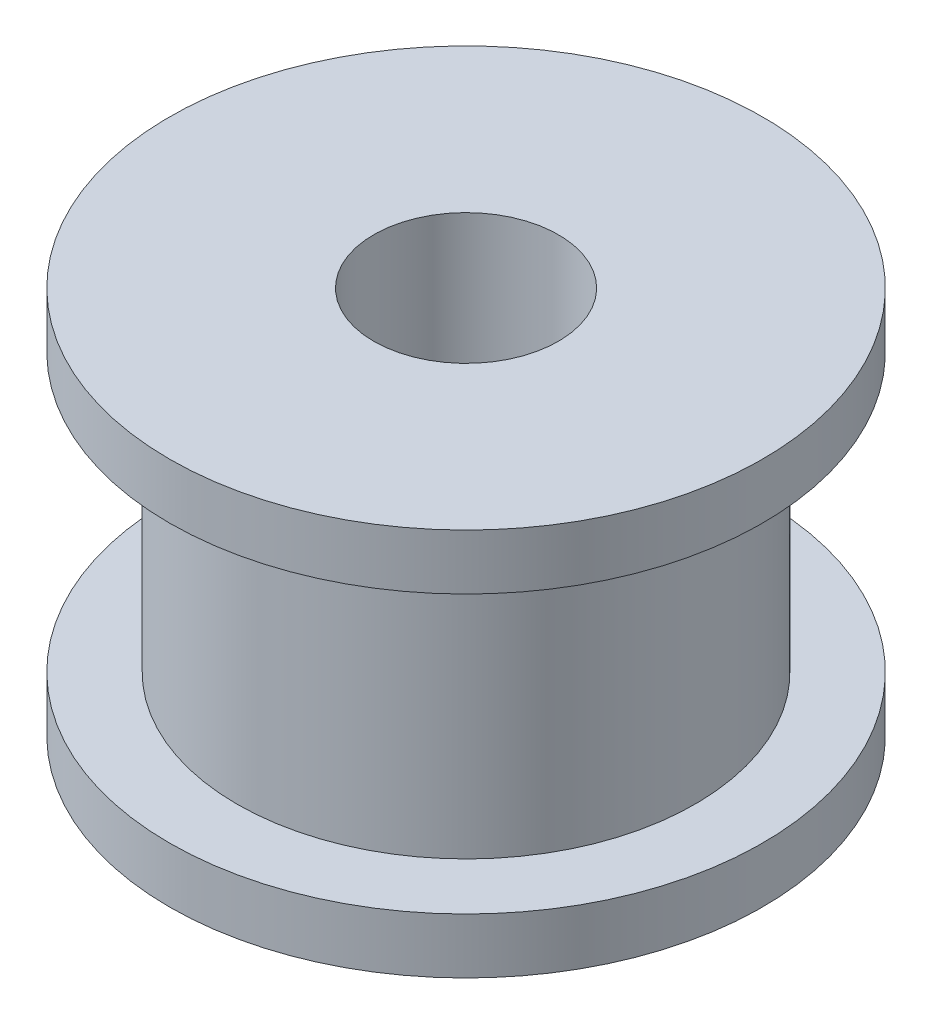
ISO-10303-21;
HEADER;
FILE_DESCRIPTION(('STEP AP214'),'2;1');
FILE_NAME('part.step','',(''),(''),'','','');
FILE_SCHEMA(('AUTOMOTIVE_DESIGN { 1 0 10303 214 1 1 1 1 }'));
ENDSEC;
DATA;
#1=APPLICATION_CONTEXT('core data for automotive mechanical design processes');
#2=APPLICATION_PROTOCOL_DEFINITION('international standard','automotive_design',2000,#1);
#3=PRODUCT_CONTEXT('',#1,'mechanical');
#4=PRODUCT('Part','Part','',(#3));
#5=PRODUCT_RELATED_PRODUCT_CATEGORY('part','',(#4));
#6=PRODUCT_DEFINITION_FORMATION('','',#4);
#7=PRODUCT_DEFINITION_CONTEXT('part definition',#1,'design');
#8=PRODUCT_DEFINITION('design','',#6,#7);
#9=PRODUCT_DEFINITION_SHAPE('','',#8);
#10=(LENGTH_UNIT() NAMED_UNIT(*) SI_UNIT(.MILLI.,.METRE.));
#11=(NAMED_UNIT(*) PLANE_ANGLE_UNIT() SI_UNIT($,.RADIAN.));
#12=(NAMED_UNIT(*) SI_UNIT($,.STERADIAN.) SOLID_ANGLE_UNIT());
#13=UNCERTAINTY_MEASURE_WITH_UNIT(LENGTH_MEASURE(1.E-05),#10,'distance_accuracy_value','');
#14=(GEOMETRIC_REPRESENTATION_CONTEXT(3) GLOBAL_UNCERTAINTY_ASSIGNED_CONTEXT((#13)) GLOBAL_UNIT_ASSIGNED_CONTEXT((#10,
#11,#12)) REPRESENTATION_CONTEXT('',''));
#15=CARTESIAN_POINT('',(0.,0.,0.));
#16=DIRECTION('',(0.,0.,1.));
#17=DIRECTION('',(1.,0.,0.));
#18=AXIS2_PLACEMENT_3D('',#15,#16,#17);
#19=CARTESIAN_POINT('',(0.,1.5,0.));
#20=DIRECTION('',(0.,-1.,0.));
#21=DIRECTION('',(0.,0.,-1.));
#22=AXIS2_PLACEMENT_3D('',#19,#20,#21);
#23=CYLINDRICAL_SURFACE('',#22,8.025);
#24=CARTESIAN_POINT('',(0.,1.5,0.));
#25=DIRECTION('',(0.,1.,0.));
#26=DIRECTION('',(0.,0.,1.));
#27=AXIS2_PLACEMENT_3D('',#24,#25,#26);
#28=CIRCLE('',#27,8.025);
#29=CARTESIAN_POINT('',(0.,1.5,8.025));
#30=VERTEX_POINT('',#29);
#31=EDGE_CURVE('E10',#30,#30,#28,.T.);
#32=ORIENTED_EDGE('',*,*,#31,.F.);
#33=EDGE_LOOP('',(#32));
#34=FACE_BOUND('',#33,.T.);
#35=CARTESIAN_POINT('',(0.,0.,0.));
#36=DIRECTION('',(0.,1.,0.));
#37=DIRECTION('',(0.,0.,1.));
#38=AXIS2_PLACEMENT_3D('',#35,#36,#37);
#39=CIRCLE('',#38,8.025);
#40=CARTESIAN_POINT('',(0.,0.,8.025));
#41=VERTEX_POINT('',#40);
#42=EDGE_CURVE('E34',#41,#41,#39,.T.);
#43=ORIENTED_EDGE('',*,*,#42,.T.);
#44=EDGE_LOOP('',(#43));
#45=FACE_BOUND('',#44,.T.);
#46=ADVANCED_FACE('F31',(#34,#45),#23,.T.);
#47=CARTESIAN_POINT('',(0.,1.5,0.));
#48=DIRECTION('',(0.,1.,0.));
#49=DIRECTION('',(0.,0.,1.));
#50=AXIS2_PLACEMENT_3D('',#47,#48,#49);
#51=PLANE('',#50);
#52=CARTESIAN_POINT('',(0.,1.5,0.));
#53=DIRECTION('',(0.,1.,0.));
#54=DIRECTION('',(0.,0.,1.));
#55=AXIS2_PLACEMENT_3D('',#52,#53,#54);
#56=CIRCLE('',#55,6.2);
#57=CARTESIAN_POINT('',(0.,1.5,6.2));
#58=VERTEX_POINT('',#57);
#59=EDGE_CURVE('E43',#58,#58,#56,.T.);
#60=ORIENTED_EDGE('',*,*,#59,.F.);
#61=EDGE_LOOP('',(#60));
#62=FACE_BOUND('',#61,.T.);
#63=ORIENTED_EDGE('',*,*,#31,.T.);
#64=EDGE_LOOP('',(#63));
#65=FACE_BOUND('',#64,.T.);
#66=ADVANCED_FACE('F90',(#62,#65),#51,.T.);
#67=CARTESIAN_POINT('',(0.,0.,0.));
#68=DIRECTION('',(0.,1.,0.));
#69=DIRECTION('',(0.,0.,1.));
#70=AXIS2_PLACEMENT_3D('',#67,#68,#69);
#71=PLANE('',#70);
#72=CARTESIAN_POINT('',(0.,0.,0.));
#73=DIRECTION('',(0.,1.,0.));
#74=DIRECTION('',(0.,0.,1.));
#75=AXIS2_PLACEMENT_3D('',#72,#73,#74);
#76=CIRCLE('',#75,2.5);
#77=CARTESIAN_POINT('',(0.,0.,2.5));
#78=VERTEX_POINT('',#77);
#79=EDGE_CURVE('E52',#78,#78,#76,.T.);
#80=ORIENTED_EDGE('',*,*,#79,.T.);
#81=EDGE_LOOP('',(#80));
#82=FACE_BOUND('',#81,.T.);
#83=ORIENTED_EDGE('',*,*,#42,.F.);
#84=EDGE_LOOP('',(#83));
#85=FACE_BOUND('',#84,.T.);
#86=ADVANCED_FACE('F61',(#82,#85),#71,.F.);
#87=CARTESIAN_POINT('',(0.,9.,0.));
#88=DIRECTION('',(0.,-1.,0.));
#89=DIRECTION('',(0.,0.,-1.));
#90=AXIS2_PLACEMENT_3D('',#87,#88,#89);
#91=CYLINDRICAL_SURFACE('',#90,6.2);
#92=CARTESIAN_POINT('',(0.,9.,0.));
#93=DIRECTION('',(0.,1.,0.));
#94=DIRECTION('',(0.,0.,1.));
#95=AXIS2_PLACEMENT_3D('',#92,#93,#94);
#96=CIRCLE('',#95,6.2);
#97=CARTESIAN_POINT('',(0.,9.,6.2));
#98=VERTEX_POINT('',#97);
#99=EDGE_CURVE('E41',#98,#98,#96,.T.);
#100=ORIENTED_EDGE('',*,*,#99,.F.);
#101=EDGE_LOOP('',(#100));
#102=FACE_BOUND('',#101,.T.);
#103=ORIENTED_EDGE('',*,*,#59,.T.);
#104=EDGE_LOOP('',(#103));
#105=FACE_BOUND('',#104,.T.);
#106=ADVANCED_FACE('F80',(#102,#105),#91,.T.);
#107=CARTESIAN_POINT('',(0.,10.5,0.));
#108=DIRECTION('',(0.,-1.,0.));
#109=DIRECTION('',(0.,0.,-1.));
#110=AXIS2_PLACEMENT_3D('',#107,#108,#109);
#111=CYLINDRICAL_SURFACE('',#110,8.025);
#112=CARTESIAN_POINT('',(0.,10.5,0.));
#113=DIRECTION('',(0.,1.,0.));
#114=DIRECTION('',(0.,0.,1.));
#115=AXIS2_PLACEMENT_3D('',#112,#113,#114);
#116=CIRCLE('',#115,8.025);
#117=CARTESIAN_POINT('',(0.,10.5,8.025));
#118=VERTEX_POINT('',#117);
#119=EDGE_CURVE('E46',#118,#118,#116,.T.);
#120=ORIENTED_EDGE('',*,*,#119,.F.);
#121=EDGE_LOOP('',(#120));
#122=FACE_BOUND('',#121,.T.);
#123=CARTESIAN_POINT('',(0.,9.,0.));
#124=DIRECTION('',(0.,1.,0.));
#125=DIRECTION('',(0.,0.,1.));
#126=AXIS2_PLACEMENT_3D('',#123,#124,#125);
#127=CIRCLE('',#126,8.025);
#128=CARTESIAN_POINT('',(0.,9.,8.025));
#129=VERTEX_POINT('',#128);
#130=EDGE_CURVE('E49',#129,#129,#127,.T.);
#131=ORIENTED_EDGE('',*,*,#130,.T.);
#132=EDGE_LOOP('',(#131));
#133=FACE_BOUND('',#132,.T.);
#134=ADVANCED_FACE('F74',(#122,#133),#111,.T.);
#135=CARTESIAN_POINT('',(0.,10.5,0.));
#136=DIRECTION('',(0.,1.,0.));
#137=DIRECTION('',(0.,0.,1.));
#138=AXIS2_PLACEMENT_3D('',#135,#136,#137);
#139=PLANE('',#138);
#140=CARTESIAN_POINT('',(0.,10.5,0.));
#141=DIRECTION('',(0.,1.,0.));
#142=DIRECTION('',(0.,0.,1.));
#143=AXIS2_PLACEMENT_3D('',#140,#141,#142);
#144=CIRCLE('',#143,2.5);
#145=CARTESIAN_POINT('',(0.,10.5,2.5));
#146=VERTEX_POINT('',#145);
#147=EDGE_CURVE('E55',#146,#146,#144,.T.);
#148=ORIENTED_EDGE('',*,*,#147,.F.);
#149=EDGE_LOOP('',(#148));
#150=FACE_BOUND('',#149,.T.);
#151=ORIENTED_EDGE('',*,*,#119,.T.);
#152=EDGE_LOOP('',(#151));
#153=FACE_BOUND('',#152,.T.);
#154=ADVANCED_FACE('F71',(#150,#153),#139,.T.);
#155=CARTESIAN_POINT('',(0.,9.,0.));
#156=DIRECTION('',(0.,1.,0.));
#157=DIRECTION('',(0.,0.,1.));
#158=AXIS2_PLACEMENT_3D('',#155,#156,#157);
#159=PLANE('',#158);
#160=ORIENTED_EDGE('',*,*,#99,.T.);
#161=EDGE_LOOP('',(#160));
#162=FACE_BOUND('',#161,.T.);
#163=ORIENTED_EDGE('',*,*,#130,.F.);
#164=EDGE_LOOP('',(#163));
#165=FACE_BOUND('',#164,.T.);
#166=ADVANCED_FACE('F67',(#162,#165),#159,.F.);
#167=CARTESIAN_POINT('',(0.,0.,0.));
#168=DIRECTION('',(0.,1.,0.));
#169=DIRECTION('',(0.,0.,1.));
#170=AXIS2_PLACEMENT_3D('',#167,#168,#169);
#171=CYLINDRICAL_SURFACE('',#170,2.5);
#172=ORIENTED_EDGE('',*,*,#79,.F.);
#173=EDGE_LOOP('',(#172));
#174=FACE_BOUND('',#173,.T.);
#175=ORIENTED_EDGE('',*,*,#147,.T.);
#176=EDGE_LOOP('',(#175));
#177=FACE_BOUND('',#176,.T.);
#178=ADVANCED_FACE('F64',(#174,#177),#171,.F.);
#179=CLOSED_SHELL('',(#46,#66,#86,#106,#134,#154,#166,#178));
#180=MANIFOLD_SOLID_BREP('B2',#179);
#181=ADVANCED_BREP_SHAPE_REPRESENTATION('',(#18,#180),#14);
#182=SHAPE_DEFINITION_REPRESENTATION(#9,#181);
ENDSEC;
END-ISO-10303-21;
